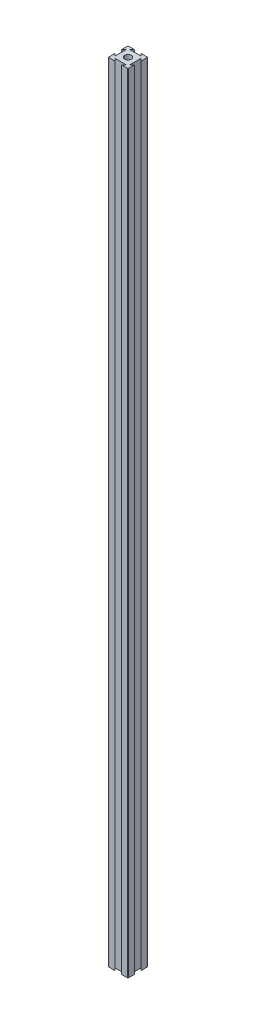
ISO-10303-21;
HEADER;
FILE_DESCRIPTION(('STEP AP214'),'2;1');
FILE_NAME('part.step','',(''),(''),'','','');
FILE_SCHEMA(('AUTOMOTIVE_DESIGN { 1 0 10303 214 1 1 1 1 }'));
ENDSEC;
DATA;
#1=APPLICATION_CONTEXT('core data for automotive mechanical design processes');
#2=APPLICATION_PROTOCOL_DEFINITION('international standard','automotive_design',2000,#1);
#3=PRODUCT_CONTEXT('',#1,'mechanical');
#4=PRODUCT('Part','Part','',(#3));
#5=PRODUCT_RELATED_PRODUCT_CATEGORY('part','',(#4));
#6=PRODUCT_DEFINITION_FORMATION('','',#4);
#7=PRODUCT_DEFINITION_CONTEXT('part definition',#1,'design');
#8=PRODUCT_DEFINITION('design','',#6,#7);
#9=PRODUCT_DEFINITION_SHAPE('','',#8);
#10=(LENGTH_UNIT() NAMED_UNIT(*) SI_UNIT(.MILLI.,.METRE.));
#11=(NAMED_UNIT(*) PLANE_ANGLE_UNIT() SI_UNIT($,.RADIAN.));
#12=(NAMED_UNIT(*) SI_UNIT($,.STERADIAN.) SOLID_ANGLE_UNIT());
#13=UNCERTAINTY_MEASURE_WITH_UNIT(LENGTH_MEASURE(1.E-05),#10,'distance_accuracy_value','');
#14=(GEOMETRIC_REPRESENTATION_CONTEXT(3) GLOBAL_UNCERTAINTY_ASSIGNED_CONTEXT((#13)) GLOBAL_UNIT_ASSIGNED_CONTEXT((#10,
#11,#12)) REPRESENTATION_CONTEXT('',''));
#15=CARTESIAN_POINT('',(0.,0.,0.));
#16=DIRECTION('',(0.,0.,1.));
#17=DIRECTION('',(1.,0.,0.));
#18=AXIS2_PLACEMENT_3D('',#15,#16,#17);
#19=CARTESIAN_POINT('',(16.6666666666667,800.1,-16.6666666666667));
#20=DIRECTION('',(-0.707106781186547,0.,0.707106781186548));
#21=DIRECTION('',(0.707106781186548,0.,0.707106781186547));
#22=AXIS2_PLACEMENT_3D('',#19,#20,#21);
#23=PLANE('',#22);
#24=DIRECTION('',(-0.707106781186548,0.,-0.707106781186547));
#25=VECTOR('',#24,1.);
#26=CARTESIAN_POINT('',(16.6666666666667,0.,-16.6666666666667));
#27=LINE('',#26,#25);
#28=CARTESIAN_POINT('',(20.,0.,-13.3333333333333));
#29=VERTEX_POINT('',#28);
#30=CARTESIAN_POINT('',(17.6183333333333,0.,-15.715));
#31=VERTEX_POINT('',#30);
#32=EDGE_CURVE('E201',#29,#31,#27,.T.);
#33=ORIENTED_EDGE('',*,*,#32,.F.);
#34=DIRECTION('',(0.,-1.,0.));
#35=VECTOR('',#34,1.);
#36=CARTESIAN_POINT('',(20.,800.1,-13.3333333333333));
#37=LINE('',#36,#35);
#38=CARTESIAN_POINT('',(20.,800.1,-13.3333333333333));
#39=VERTEX_POINT('',#38);
#40=EDGE_CURVE('E195',#39,#29,#37,.T.);
#41=ORIENTED_EDGE('',*,*,#40,.F.);
#42=DIRECTION('',(-0.707106781186548,0.,-0.707106781186547));
#43=VECTOR('',#42,1.);
#44=CARTESIAN_POINT('',(16.6666666666667,800.1,-16.6666666666667));
#45=LINE('',#44,#43);
#46=CARTESIAN_POINT('',(17.6183333333333,800.1,-15.715));
#47=VERTEX_POINT('',#46);
#48=EDGE_CURVE('E198',#39,#47,#45,.T.);
#49=ORIENTED_EDGE('',*,*,#48,.T.);
#50=DIRECTION('',(0.,-1.,0.));
#51=VECTOR('',#50,1.);
#52=CARTESIAN_POINT('',(17.6183333333333,800.1,-15.715));
#53=LINE('',#52,#51);
#54=EDGE_CURVE('E269',#47,#31,#53,.T.);
#55=ORIENTED_EDGE('',*,*,#54,.T.);
#56=EDGE_LOOP('',(#33,#41,#49,#55));
#57=FACE_BOUND('',#56,.T.);
#58=ADVANCED_FACE('F35',(#57),#23,.T.);
#59=CARTESIAN_POINT('',(20.,800.1,0.));
#60=DIRECTION('',(-1.,0.,0.));
#61=DIRECTION('',(0.,0.,1.));
#62=AXIS2_PLACEMENT_3D('',#59,#60,#61);
#63=PLANE('',#62);
#64=DIRECTION('',(0.,0.,-1.));
#65=VECTOR('',#64,1.);
#66=CARTESIAN_POINT('',(20.,0.,0.));
#67=LINE('',#66,#65);
#68=CARTESIAN_POINT('',(20.,0.,-19.492));
#69=VERTEX_POINT('',#68);
#70=EDGE_CURVE('E274',#29,#69,#67,.T.);
#71=ORIENTED_EDGE('',*,*,#70,.T.);
#72=DIRECTION('',(0.,-1.,0.));
#73=VECTOR('',#72,1.);
#74=CARTESIAN_POINT('',(20.,800.1,-19.492));
#75=LINE('',#74,#73);
#76=CARTESIAN_POINT('',(20.,800.1,-19.492));
#77=VERTEX_POINT('',#76);
#78=EDGE_CURVE('E212',#69,#77,#75,.F.);
#79=ORIENTED_EDGE('',*,*,#78,.T.);
#80=DIRECTION('',(0.,0.,-1.));
#81=VECTOR('',#80,1.);
#82=CARTESIAN_POINT('',(20.,800.1,0.));
#83=LINE('',#82,#81);
#84=EDGE_CURVE('E209',#39,#77,#83,.T.);
#85=ORIENTED_EDGE('',*,*,#84,.F.);
#86=ORIENTED_EDGE('',*,*,#40,.T.);
#87=EDGE_LOOP('',(#71,#79,#85,#86));
#88=FACE_BOUND('',#87,.T.);
#89=ADVANCED_FACE('F210',(#88),#63,.F.);
#90=CARTESIAN_POINT('',(0.,800.1,-20.));
#91=DIRECTION('',(0.,0.,-1.));
#92=DIRECTION('',(-1.,0.,0.));
#93=AXIS2_PLACEMENT_3D('',#90,#91,#92);
#94=PLANE('',#93);
#95=DIRECTION('',(1.,0.,0.));
#96=VECTOR('',#95,1.);
#97=CARTESIAN_POINT('',(0.,800.1,-20.));
#98=LINE('',#97,#96);
#99=CARTESIAN_POINT('',(13.3333333333333,800.1,-20.));
#100=VERTEX_POINT('',#99);
#101=CARTESIAN_POINT('',(19.492,800.1,-20.));
#102=VERTEX_POINT('',#101);
#103=EDGE_CURVE('E214',#100,#102,#98,.T.);
#104=ORIENTED_EDGE('',*,*,#103,.T.);
#105=DIRECTION('',(0.,-1.,0.));
#106=VECTOR('',#105,1.);
#107=CARTESIAN_POINT('',(19.492,0.,-20.));
#108=LINE('',#107,#106);
#109=CARTESIAN_POINT('',(19.492,0.,-20.));
#110=VERTEX_POINT('',#109);
#111=EDGE_CURVE('E376',#102,#110,#108,.T.);
#112=ORIENTED_EDGE('',*,*,#111,.T.);
#113=DIRECTION('',(1.,0.,0.));
#114=VECTOR('',#113,1.);
#115=CARTESIAN_POINT('',(0.,0.,-20.));
#116=LINE('',#115,#114);
#117=CARTESIAN_POINT('',(13.3333333333333,0.,-20.));
#118=VERTEX_POINT('',#117);
#119=EDGE_CURVE('E276',#118,#110,#116,.T.);
#120=ORIENTED_EDGE('',*,*,#119,.F.);
#121=DIRECTION('',(0.,-1.,0.));
#122=VECTOR('',#121,1.);
#123=CARTESIAN_POINT('',(13.3333333333333,800.1,-20.));
#124=LINE('',#123,#122);
#125=EDGE_CURVE('E206',#100,#118,#124,.T.);
#126=ORIENTED_EDGE('',*,*,#125,.F.);
#127=EDGE_LOOP('',(#104,#112,#120,#126));
#128=FACE_BOUND('',#127,.T.);
#129=ADVANCED_FACE('F408',(#128),#94,.T.);
#130=CARTESIAN_POINT('',(16.6666666666666,800.1,-16.6666666666668));
#131=DIRECTION('',(-0.707106781186544,0.,0.707106781186551));
#132=DIRECTION('',(0.707106781186551,0.,0.707106781186544));
#133=AXIS2_PLACEMENT_3D('',#130,#131,#132);
#134=PLANE('',#133);
#135=DIRECTION('',(-0.707106781186551,0.,-0.707106781186544));
#136=VECTOR('',#135,1.);
#137=CARTESIAN_POINT('',(16.6666666666666,0.,-16.6666666666668));
#138=LINE('',#137,#136);
#139=CARTESIAN_POINT('',(15.715,0.,-17.6183333333334));
#140=VERTEX_POINT('',#139);
#141=EDGE_CURVE('E280',#140,#118,#138,.T.);
#142=ORIENTED_EDGE('',*,*,#141,.F.);
#143=DIRECTION('',(0.,-1.,0.));
#144=VECTOR('',#143,1.);
#145=CARTESIAN_POINT('',(15.715,800.1,-17.6183333333334));
#146=LINE('',#145,#144);
#147=CARTESIAN_POINT('',(15.715,800.1,-17.6183333333334));
#148=VERTEX_POINT('',#147);
#149=EDGE_CURVE('E354',#148,#140,#146,.T.);
#150=ORIENTED_EDGE('',*,*,#149,.F.);
#151=DIRECTION('',(-0.707106781186551,0.,-0.707106781186544));
#152=VECTOR('',#151,1.);
#153=CARTESIAN_POINT('',(16.6666666666666,800.1,-16.6666666666668));
#154=LINE('',#153,#152);
#155=EDGE_CURVE('E230',#148,#100,#154,.T.);
#156=ORIENTED_EDGE('',*,*,#155,.T.);
#157=ORIENTED_EDGE('',*,*,#125,.T.);
#158=EDGE_LOOP('',(#142,#150,#156,#157));
#159=FACE_BOUND('',#158,.T.);
#160=ADVANCED_FACE('F412',(#159),#134,.T.);
#161=CARTESIAN_POINT('',(0.,800.1,-17.6183333333334));
#162=DIRECTION('',(0.,0.,-1.));
#163=DIRECTION('',(-1.,0.,0.));
#164=AXIS2_PLACEMENT_3D('',#161,#162,#163);
#165=PLANE('',#164);
#166=DIRECTION('',(1.,0.,0.));
#167=VECTOR('',#166,1.);
#168=CARTESIAN_POINT('',(0.,0.,-17.6183333333334));
#169=LINE('',#168,#167);
#170=CARTESIAN_POINT('',(4.285,0.,-17.6183333333334));
#171=VERTEX_POINT('',#170);
#172=EDGE_CURVE('E284',#171,#140,#169,.T.);
#173=ORIENTED_EDGE('',*,*,#172,.F.);
#174=DIRECTION('',(0.,-1.,0.));
#175=VECTOR('',#174,1.);
#176=CARTESIAN_POINT('',(4.285,800.1,-17.6183333333334));
#177=LINE('',#176,#175);
#178=CARTESIAN_POINT('',(4.285,800.1,-17.6183333333334));
#179=VERTEX_POINT('',#178);
#180=EDGE_CURVE('E352',#179,#171,#177,.T.);
#181=ORIENTED_EDGE('',*,*,#180,.F.);
#182=DIRECTION('',(1.,0.,0.));
#183=VECTOR('',#182,1.);
#184=CARTESIAN_POINT('',(0.,800.1,-17.6183333333334));
#185=LINE('',#184,#183);
#186=EDGE_CURVE('E234',#179,#148,#185,.T.);
#187=ORIENTED_EDGE('',*,*,#186,.T.);
#188=ORIENTED_EDGE('',*,*,#149,.T.);
#189=EDGE_LOOP('',(#173,#181,#187,#188));
#190=FACE_BOUND('',#189,.T.);
#191=ADVANCED_FACE('F439',(#190),#165,.T.);
#192=CARTESIAN_POINT('',(-6.6666666666667,800.1,-6.66666666666677));
#193=DIRECTION('',(0.707106781186544,0.,0.707106781186551));
#194=DIRECTION('',(0.707106781186551,0.,-0.707106781186544));
#195=AXIS2_PLACEMENT_3D('',#192,#193,#194);
#196=PLANE('',#195);
#197=DIRECTION('',(-0.707106781186551,0.,0.707106781186544));
#198=VECTOR('',#197,1.);
#199=CARTESIAN_POINT('',(-6.6666666666667,0.,-6.66666666666677));
#200=LINE('',#199,#198);
#201=CARTESIAN_POINT('',(6.66666666666666,0.,-20.));
#202=VERTEX_POINT('',#201);
#203=EDGE_CURVE('E287',#202,#171,#200,.T.);
#204=ORIENTED_EDGE('',*,*,#203,.F.);
#205=DIRECTION('',(0.,-1.,0.));
#206=VECTOR('',#205,1.);
#207=CARTESIAN_POINT('',(6.66666666666666,800.1,-20.));
#208=LINE('',#207,#206);
#209=CARTESIAN_POINT('',(6.66666666666666,800.1,-20.));
#210=VERTEX_POINT('',#209);
#211=EDGE_CURVE('E349',#210,#202,#208,.T.);
#212=ORIENTED_EDGE('',*,*,#211,.F.);
#213=DIRECTION('',(-0.707106781186551,0.,0.707106781186544));
#214=VECTOR('',#213,1.);
#215=CARTESIAN_POINT('',(-6.6666666666667,800.1,-6.66666666666677));
#216=LINE('',#215,#214);
#217=EDGE_CURVE('E237',#210,#179,#216,.T.);
#218=ORIENTED_EDGE('',*,*,#217,.T.);
#219=ORIENTED_EDGE('',*,*,#180,.T.);
#220=EDGE_LOOP('',(#204,#212,#218,#219));
#221=FACE_BOUND('',#220,.T.);
#222=ADVANCED_FACE('F442',(#221),#196,.T.);
#223=CARTESIAN_POINT('',(0.508,0.,-20.));
#224=VERTEX_POINT('',#223);
#225=EDGE_CURVE('E281',#224,#202,#116,.T.);
#226=ORIENTED_EDGE('',*,*,#225,.F.);
#227=DIRECTION('',(0.,-1.,0.));
#228=VECTOR('',#227,1.);
#229=CARTESIAN_POINT('',(0.508,800.1,-20.));
#230=LINE('',#229,#228);
#231=CARTESIAN_POINT('',(0.508,800.1,-20.));
#232=VERTEX_POINT('',#231);
#233=EDGE_CURVE('E367',#224,#232,#230,.F.);
#234=ORIENTED_EDGE('',*,*,#233,.T.);
#235=EDGE_CURVE('E231',#232,#210,#98,.T.);
#236=ORIENTED_EDGE('',*,*,#235,.T.);
#237=ORIENTED_EDGE('',*,*,#211,.T.);
#238=EDGE_LOOP('',(#226,#234,#236,#237));
#239=FACE_BOUND('',#238,.T.);
#240=ADVANCED_FACE('F505',(#239),#94,.T.);
#241=CARTESIAN_POINT('',(0.,800.1,0.));
#242=DIRECTION('',(-1.,0.,0.));
#243=DIRECTION('',(0.,0.,1.));
#244=AXIS2_PLACEMENT_3D('',#241,#242,#243);
#245=PLANE('',#244);
#246=DIRECTION('',(0.,0.,-1.));
#247=VECTOR('',#246,1.);
#248=CARTESIAN_POINT('',(0.,800.1,0.));
#249=LINE('',#248,#247);
#250=CARTESIAN_POINT('',(0.,800.1,-13.3333333333333));
#251=VERTEX_POINT('',#250);
#252=CARTESIAN_POINT('',(0.,800.1,-19.492));
#253=VERTEX_POINT('',#252);
#254=EDGE_CURVE('E240',#251,#253,#249,.T.);
#255=ORIENTED_EDGE('',*,*,#254,.T.);
#256=DIRECTION('',(0.,-1.,0.));
#257=VECTOR('',#256,1.);
#258=CARTESIAN_POINT('',(0.,800.1,-19.492));
#259=LINE('',#258,#257);
#260=CARTESIAN_POINT('',(0.,0.,-19.492));
#261=VERTEX_POINT('',#260);
#262=EDGE_CURVE('E205',#253,#261,#259,.T.);
#263=ORIENTED_EDGE('',*,*,#262,.T.);
#264=DIRECTION('',(0.,0.,-1.));
#265=VECTOR('',#264,1.);
#266=CARTESIAN_POINT('',(0.,0.,0.));
#267=LINE('',#266,#265);
#268=CARTESIAN_POINT('',(0.,0.,-13.3333333333333));
#269=VERTEX_POINT('',#268);
#270=EDGE_CURVE('E290',#269,#261,#267,.T.);
#271=ORIENTED_EDGE('',*,*,#270,.F.);
#272=DIRECTION('',(0.,-1.,0.));
#273=VECTOR('',#272,1.);
#274=CARTESIAN_POINT('',(0.,800.1,-13.3333333333333));
#275=LINE('',#274,#273);
#276=EDGE_CURVE('E347',#251,#269,#275,.T.);
#277=ORIENTED_EDGE('',*,*,#276,.F.);
#278=EDGE_LOOP('',(#255,#263,#271,#277));
#279=FACE_BOUND('',#278,.T.);
#280=ADVANCED_FACE('F451',(#279),#245,.T.);
#281=CARTESIAN_POINT('',(-6.66666666666667,800.1,-6.66666666666669));
#282=DIRECTION('',(-0.707106781186546,0.,-0.707106781186549));
#283=DIRECTION('',(-0.707106781186549,0.,0.707106781186546));
#284=AXIS2_PLACEMENT_3D('',#281,#282,#283);
#285=PLANE('',#284);
#286=DIRECTION('',(0.707106781186549,0.,-0.707106781186547));
#287=VECTOR('',#286,1.);
#288=CARTESIAN_POINT('',(-6.66666666666667,0.,-6.66666666666669));
#289=LINE('',#288,#287);
#290=CARTESIAN_POINT('',(2.38166666666667,0.,-15.715));
#291=VERTEX_POINT('',#290);
#292=EDGE_CURVE('E293',#269,#291,#289,.T.);
#293=ORIENTED_EDGE('',*,*,#292,.T.);
#294=DIRECTION('',(0.,-1.,0.));
#295=VECTOR('',#294,1.);
#296=CARTESIAN_POINT('',(2.38166666666667,800.1,-15.715));
#297=LINE('',#296,#295);
#298=CARTESIAN_POINT('',(2.38166666666667,800.1,-15.715));
#299=VERTEX_POINT('',#298);
#300=EDGE_CURVE('E344',#299,#291,#297,.T.);
#301=ORIENTED_EDGE('',*,*,#300,.F.);
#302=DIRECTION('',(0.707106781186549,0.,-0.707106781186547));
#303=VECTOR('',#302,1.);
#304=CARTESIAN_POINT('',(-6.66666666666667,800.1,-6.66666666666669));
#305=LINE('',#304,#303);
#306=EDGE_CURVE('E243',#251,#299,#305,.T.);
#307=ORIENTED_EDGE('',*,*,#306,.F.);
#308=ORIENTED_EDGE('',*,*,#276,.T.);
#309=EDGE_LOOP('',(#293,#301,#307,#308));
#310=FACE_BOUND('',#309,.T.);
#311=ADVANCED_FACE('F456',(#310),#285,.F.);
#312=CARTESIAN_POINT('',(2.38166666666667,800.1,0.));
#313=DIRECTION('',(1.,0.,0.));
#314=DIRECTION('',(0.,0.,-1.));
#315=AXIS2_PLACEMENT_3D('',#312,#313,#314);
#316=PLANE('',#315);
#317=DIRECTION('',(0.,0.,1.));
#318=VECTOR('',#317,1.);
#319=CARTESIAN_POINT('',(2.38166666666667,0.,0.));
#320=LINE('',#319,#318);
#321=CARTESIAN_POINT('',(2.38166666666667,0.,-4.285));
#322=VERTEX_POINT('',#321);
#323=EDGE_CURVE('E297',#291,#322,#320,.T.);
#324=ORIENTED_EDGE('',*,*,#323,.T.);
#325=DIRECTION('',(0.,-1.,0.));
#326=VECTOR('',#325,1.);
#327=CARTESIAN_POINT('',(2.38166666666667,800.1,-4.285));
#328=LINE('',#327,#326);
#329=CARTESIAN_POINT('',(2.38166666666667,800.1,-4.285));
#330=VERTEX_POINT('',#329);
#331=EDGE_CURVE('E341',#330,#322,#328,.T.);
#332=ORIENTED_EDGE('',*,*,#331,.F.);
#333=DIRECTION('',(0.,0.,1.));
#334=VECTOR('',#333,1.);
#335=CARTESIAN_POINT('',(2.38166666666667,800.1,0.));
#336=LINE('',#335,#334);
#337=EDGE_CURVE('E247',#299,#330,#336,.T.);
#338=ORIENTED_EDGE('',*,*,#337,.F.);
#339=ORIENTED_EDGE('',*,*,#300,.T.);
#340=EDGE_LOOP('',(#324,#332,#338,#339));
#341=FACE_BOUND('',#340,.T.);
#342=ADVANCED_FACE('F462',(#341),#316,.F.);
#343=CARTESIAN_POINT('',(3.33333333333333,800.1,-3.33333333333335));
#344=DIRECTION('',(-0.707106781186546,0.,0.707106781186549));
#345=DIRECTION('',(0.707106781186549,0.,0.707106781186546));
#346=AXIS2_PLACEMENT_3D('',#343,#344,#345);
#347=PLANE('',#346);
#348=DIRECTION('',(-0.707106781186549,0.,-0.707106781186546));
#349=VECTOR('',#348,1.);
#350=CARTESIAN_POINT('',(3.33333333333333,0.,-3.33333333333335));
#351=LINE('',#350,#349);
#352=CARTESIAN_POINT('',(0.,0.,-6.66666666666667));
#353=VERTEX_POINT('',#352);
#354=EDGE_CURVE('E300',#322,#353,#351,.T.);
#355=ORIENTED_EDGE('',*,*,#354,.T.);
#356=DIRECTION('',(0.,-1.,0.));
#357=VECTOR('',#356,1.);
#358=CARTESIAN_POINT('',(0.,800.1,-6.66666666666667));
#359=LINE('',#358,#357);
#360=CARTESIAN_POINT('',(0.,800.1,-6.66666666666667));
#361=VERTEX_POINT('',#360);
#362=EDGE_CURVE('E338',#361,#353,#359,.T.);
#363=ORIENTED_EDGE('',*,*,#362,.F.);
#364=DIRECTION('',(-0.707106781186549,0.,-0.707106781186546));
#365=VECTOR('',#364,1.);
#366=CARTESIAN_POINT('',(3.33333333333333,800.1,-3.33333333333335));
#367=LINE('',#366,#365);
#368=EDGE_CURVE('E250',#330,#361,#367,.T.);
#369=ORIENTED_EDGE('',*,*,#368,.F.);
#370=ORIENTED_EDGE('',*,*,#331,.T.);
#371=EDGE_LOOP('',(#355,#363,#369,#370));
#372=FACE_BOUND('',#371,.T.);
#373=ADVANCED_FACE('F464',(#372),#347,.F.);
#374=CARTESIAN_POINT('',(0.,0.,-0.508));
#375=VERTEX_POINT('',#374);
#376=EDGE_CURVE('E294',#375,#353,#267,.T.);
#377=ORIENTED_EDGE('',*,*,#376,.F.);
#378=DIRECTION('',(0.,-1.,0.));
#379=VECTOR('',#378,1.);
#380=CARTESIAN_POINT('',(0.,800.1,-0.508));
#381=LINE('',#380,#379);
#382=CARTESIAN_POINT('',(0.,800.1,-0.508));
#383=VERTEX_POINT('',#382);
#384=EDGE_CURVE('E383',#375,#383,#381,.F.);
#385=ORIENTED_EDGE('',*,*,#384,.T.);
#386=EDGE_CURVE('E244',#383,#361,#249,.T.);
#387=ORIENTED_EDGE('',*,*,#386,.T.);
#388=ORIENTED_EDGE('',*,*,#362,.T.);
#389=EDGE_LOOP('',(#377,#385,#387,#388));
#390=FACE_BOUND('',#389,.T.);
#391=ADVANCED_FACE('F467',(#390),#245,.T.);
#392=CARTESIAN_POINT('',(0.,800.1,0.));
#393=DIRECTION('',(0.,0.,-1.));
#394=DIRECTION('',(-1.,0.,0.));
#395=AXIS2_PLACEMENT_3D('',#392,#393,#394);
#396=PLANE('',#395);
#397=DIRECTION('',(1.,0.,0.));
#398=VECTOR('',#397,1.);
#399=CARTESIAN_POINT('',(0.,800.1,0.));
#400=LINE('',#399,#398);
#401=CARTESIAN_POINT('',(0.508,800.1,0.));
#402=VERTEX_POINT('',#401);
#403=CARTESIAN_POINT('',(6.66666666666667,800.1,0.));
#404=VERTEX_POINT('',#403);
#405=EDGE_CURVE('E253',#402,#404,#400,.T.);
#406=ORIENTED_EDGE('',*,*,#405,.F.);
#407=DIRECTION('',(0.,-1.,0.));
#408=VECTOR('',#407,1.);
#409=CARTESIAN_POINT('',(0.508,0.,0.));
#410=LINE('',#409,#408);
#411=CARTESIAN_POINT('',(0.508,0.,0.));
#412=VERTEX_POINT('',#411);
#413=EDGE_CURVE('E380',#402,#412,#410,.T.);
#414=ORIENTED_EDGE('',*,*,#413,.T.);
#415=DIRECTION('',(1.,0.,0.));
#416=VECTOR('',#415,1.);
#417=CARTESIAN_POINT('',(0.,0.,0.));
#418=LINE('',#417,#416);
#419=CARTESIAN_POINT('',(6.66666666666667,0.,0.));
#420=VERTEX_POINT('',#419);
#421=EDGE_CURVE('E303',#412,#420,#418,.T.);
#422=ORIENTED_EDGE('',*,*,#421,.T.);
#423=DIRECTION('',(0.,-1.,0.));
#424=VECTOR('',#423,1.);
#425=CARTESIAN_POINT('',(6.66666666666667,800.1,0.));
#426=LINE('',#425,#424);
#427=EDGE_CURVE('E335',#404,#420,#426,.T.);
#428=ORIENTED_EDGE('',*,*,#427,.F.);
#429=EDGE_LOOP('',(#406,#414,#422,#428));
#430=FACE_BOUND('',#429,.T.);
#431=ADVANCED_FACE('F474',(#430),#396,.F.);
#432=CARTESIAN_POINT('',(3.3333333333333,800.1,-3.33333333333333));
#433=DIRECTION('',(-0.707106781186544,0.,0.707106781186551));
#434=DIRECTION('',(0.707106781186551,0.,0.707106781186544));
#435=AXIS2_PLACEMENT_3D('',#432,#433,#434);
#436=PLANE('',#435);
#437=DIRECTION('',(-0.707106781186551,0.,-0.707106781186544));
#438=VECTOR('',#437,1.);
#439=CARTESIAN_POINT('',(3.3333333333333,0.,-3.33333333333333));
#440=LINE('',#439,#438);
#441=CARTESIAN_POINT('',(4.285,0.,-2.38166666666664));
#442=VERTEX_POINT('',#441);
#443=EDGE_CURVE('E305',#420,#442,#440,.T.);
#444=ORIENTED_EDGE('',*,*,#443,.T.);
#445=DIRECTION('',(0.,-1.,0.));
#446=VECTOR('',#445,1.);
#447=CARTESIAN_POINT('',(4.285,800.1,-2.38166666666664));
#448=LINE('',#447,#446);
#449=CARTESIAN_POINT('',(4.285,800.1,-2.38166666666664));
#450=VERTEX_POINT('',#449);
#451=EDGE_CURVE('E332',#450,#442,#448,.T.);
#452=ORIENTED_EDGE('',*,*,#451,.F.);
#453=DIRECTION('',(-0.707106781186551,0.,-0.707106781186544));
#454=VECTOR('',#453,1.);
#455=CARTESIAN_POINT('',(3.3333333333333,800.1,-3.33333333333333));
#456=LINE('',#455,#454);
#457=EDGE_CURVE('E255',#404,#450,#456,.T.);
#458=ORIENTED_EDGE('',*,*,#457,.F.);
#459=ORIENTED_EDGE('',*,*,#427,.T.);
#460=EDGE_LOOP('',(#444,#452,#458,#459));
#461=FACE_BOUND('',#460,.T.);
#462=ADVANCED_FACE('F480',(#461),#436,.F.);
#463=CARTESIAN_POINT('',(0.,800.1,-2.38166666666664));
#464=DIRECTION('',(0.,0.,-1.));
#465=DIRECTION('',(-1.,0.,0.));
#466=AXIS2_PLACEMENT_3D('',#463,#464,#465);
#467=PLANE('',#466);
#468=DIRECTION('',(1.,0.,0.));
#469=VECTOR('',#468,1.);
#470=CARTESIAN_POINT('',(0.,0.,-2.38166666666664));
#471=LINE('',#470,#469);
#472=CARTESIAN_POINT('',(15.715,0.,-2.38166666666664));
#473=VERTEX_POINT('',#472);
#474=EDGE_CURVE('E309',#442,#473,#471,.T.);
#475=ORIENTED_EDGE('',*,*,#474,.T.);
#476=DIRECTION('',(0.,-1.,0.));
#477=VECTOR('',#476,1.);
#478=CARTESIAN_POINT('',(15.715,800.1,-2.38166666666664));
#479=LINE('',#478,#477);
#480=CARTESIAN_POINT('',(15.715,800.1,-2.38166666666664));
#481=VERTEX_POINT('',#480);
#482=EDGE_CURVE('E329',#481,#473,#479,.T.);
#483=ORIENTED_EDGE('',*,*,#482,.F.);
#484=DIRECTION('',(1.,0.,0.));
#485=VECTOR('',#484,1.);
#486=CARTESIAN_POINT('',(0.,800.1,-2.38166666666664));
#487=LINE('',#486,#485);
#488=EDGE_CURVE('E259',#450,#481,#487,.T.);
#489=ORIENTED_EDGE('',*,*,#488,.F.);
#490=ORIENTED_EDGE('',*,*,#451,.T.);
#491=EDGE_LOOP('',(#475,#483,#489,#490));
#492=FACE_BOUND('',#491,.T.);
#493=ADVANCED_FACE('F483',(#492),#467,.F.);
#494=CARTESIAN_POINT('',(6.66666666666659,800.1,6.66666666666667));
#495=DIRECTION('',(0.707106781186544,0.,0.707106781186551));
#496=DIRECTION('',(0.707106781186551,0.,-0.707106781186544));
#497=AXIS2_PLACEMENT_3D('',#494,#495,#496);
#498=PLANE('',#497);
#499=DIRECTION('',(-0.707106781186551,0.,0.707106781186544));
#500=VECTOR('',#499,1.);
#501=CARTESIAN_POINT('',(6.66666666666659,0.,6.66666666666667));
#502=LINE('',#501,#500);
#503=CARTESIAN_POINT('',(13.3333333333333,0.,0.));
#504=VERTEX_POINT('',#503);
#505=EDGE_CURVE('E312',#473,#504,#502,.T.);
#506=ORIENTED_EDGE('',*,*,#505,.T.);
#507=DIRECTION('',(0.,-1.,0.));
#508=VECTOR('',#507,1.);
#509=CARTESIAN_POINT('',(13.3333333333333,800.1,0.));
#510=LINE('',#509,#508);
#511=CARTESIAN_POINT('',(13.3333333333333,800.1,0.));
#512=VERTEX_POINT('',#511);
#513=EDGE_CURVE('E326',#512,#504,#510,.T.);
#514=ORIENTED_EDGE('',*,*,#513,.F.);
#515=DIRECTION('',(-0.707106781186551,0.,0.707106781186544));
#516=VECTOR('',#515,1.);
#517=CARTESIAN_POINT('',(6.66666666666659,800.1,6.66666666666667));
#518=LINE('',#517,#516);
#519=EDGE_CURVE('E262',#481,#512,#518,.T.);
#520=ORIENTED_EDGE('',*,*,#519,.F.);
#521=ORIENTED_EDGE('',*,*,#482,.T.);
#522=EDGE_LOOP('',(#506,#514,#520,#521));
#523=FACE_BOUND('',#522,.T.);
#524=ADVANCED_FACE('F485',(#523),#498,.F.);
#525=CARTESIAN_POINT('',(19.492,0.,0.));
#526=VERTEX_POINT('',#525);
#527=EDGE_CURVE('E306',#504,#526,#418,.T.);
#528=ORIENTED_EDGE('',*,*,#527,.T.);
#529=DIRECTION('',(0.,-1.,0.));
#530=VECTOR('',#529,1.);
#531=CARTESIAN_POINT('',(19.492,800.1,0.));
#532=LINE('',#531,#530);
#533=CARTESIAN_POINT('',(19.492,800.1,0.));
#534=VERTEX_POINT('',#533);
#535=EDGE_CURVE('E11',#526,#534,#532,.F.);
#536=ORIENTED_EDGE('',*,*,#535,.T.);
#537=EDGE_CURVE('E256',#512,#534,#400,.T.);
#538=ORIENTED_EDGE('',*,*,#537,.F.);
#539=ORIENTED_EDGE('',*,*,#513,.T.);
#540=EDGE_LOOP('',(#528,#536,#538,#539));
#541=FACE_BOUND('',#540,.T.);
#542=ADVANCED_FACE('F394',(#541),#396,.F.);
#543=CARTESIAN_POINT('',(20.,800.1,-0.508));
#544=VERTEX_POINT('',#543);
#545=CARTESIAN_POINT('',(20.,800.1,-6.66666666666667));
#546=VERTEX_POINT('',#545);
#547=EDGE_CURVE('E216',#544,#546,#83,.T.);
#548=ORIENTED_EDGE('',*,*,#547,.F.);
#549=DIRECTION('',(0.,-1.,0.));
#550=VECTOR('',#549,1.);
#551=CARTESIAN_POINT('',(20.,800.1,-0.508));
#552=LINE('',#551,#550);
#553=CARTESIAN_POINT('',(20.,0.,-0.508));
#554=VERTEX_POINT('',#553);
#555=EDGE_CURVE('E43',#544,#554,#552,.T.);
#556=ORIENTED_EDGE('',*,*,#555,.T.);
#557=CARTESIAN_POINT('',(20.,0.,-6.66666666666667));
#558=VERTEX_POINT('',#557);
#559=EDGE_CURVE('E277',#554,#558,#67,.T.);
#560=ORIENTED_EDGE('',*,*,#559,.T.);
#561=DIRECTION('',(0.,-1.,0.));
#562=VECTOR('',#561,1.);
#563=CARTESIAN_POINT('',(20.,800.1,-6.66666666666667));
#564=LINE('',#563,#562);
#565=EDGE_CURVE('E323',#546,#558,#564,.T.);
#566=ORIENTED_EDGE('',*,*,#565,.F.);
#567=EDGE_LOOP('',(#548,#556,#560,#566));
#568=FACE_BOUND('',#567,.T.);
#569=ADVANCED_FACE('F388',(#568),#63,.F.);
#570=CARTESIAN_POINT('',(6.66666666666663,800.1,6.66666666666666));
#571=DIRECTION('',(-0.707106781186546,0.,-0.707106781186549));
#572=DIRECTION('',(-0.707106781186549,0.,0.707106781186546));
#573=AXIS2_PLACEMENT_3D('',#570,#571,#572);
#574=PLANE('',#573);
#575=DIRECTION('',(0.707106781186549,0.,-0.707106781186546));
#576=VECTOR('',#575,1.);
#577=CARTESIAN_POINT('',(6.66666666666663,0.,6.66666666666666));
#578=LINE('',#577,#576);
#579=CARTESIAN_POINT('',(17.6183333333333,0.,-4.285));
#580=VERTEX_POINT('',#579);
#581=EDGE_CURVE('E315',#580,#558,#578,.T.);
#582=ORIENTED_EDGE('',*,*,#581,.F.);
#583=DIRECTION('',(0.,-1.,0.));
#584=VECTOR('',#583,1.);
#585=CARTESIAN_POINT('',(17.6183333333333,800.1,-4.285));
#586=LINE('',#585,#584);
#587=CARTESIAN_POINT('',(17.6183333333333,800.1,-4.285));
#588=VERTEX_POINT('',#587);
#589=EDGE_CURVE('E321',#588,#580,#586,.T.);
#590=ORIENTED_EDGE('',*,*,#589,.F.);
#591=DIRECTION('',(0.707106781186549,0.,-0.707106781186546));
#592=VECTOR('',#591,1.);
#593=CARTESIAN_POINT('',(6.66666666666663,800.1,6.66666666666666));
#594=LINE('',#593,#592);
#595=EDGE_CURVE('E265',#588,#546,#594,.T.);
#596=ORIENTED_EDGE('',*,*,#595,.T.);
#597=ORIENTED_EDGE('',*,*,#565,.T.);
#598=EDGE_LOOP('',(#582,#590,#596,#597));
#599=FACE_BOUND('',#598,.T.);
#600=ADVANCED_FACE('F418',(#599),#574,.T.);
#601=CARTESIAN_POINT('',(10.,800.1,-10.));
#602=DIRECTION('',(0.,-1.,0.));
#603=DIRECTION('',(0.,0.,-1.));
#604=AXIS2_PLACEMENT_3D('',#601,#602,#603);
#605=CYLINDRICAL_SURFACE('',#604,3.33333333333333);
#606=CARTESIAN_POINT('',(10.,800.1,-10.));
#607=DIRECTION('',(0.,1.,0.));
#608=DIRECTION('',(0.,0.,1.));
#609=AXIS2_PLACEMENT_3D('',#606,#607,#608);
#610=CIRCLE('',#609,3.33333333333333);
#611=CARTESIAN_POINT('',(10.,800.1,-6.66666666666667));
#612=VERTEX_POINT('',#611);
#613=EDGE_CURVE('E222',#612,#612,#610,.T.);
#614=ORIENTED_EDGE('',*,*,#613,.T.);
#615=EDGE_LOOP('',(#614));
#616=FACE_BOUND('',#615,.T.);
#617=CARTESIAN_POINT('',(10.,0.,-10.));
#618=DIRECTION('',(0.,1.,0.));
#619=DIRECTION('',(0.,0.,1.));
#620=AXIS2_PLACEMENT_3D('',#617,#618,#619);
#621=CIRCLE('',#620,3.33333333333333);
#622=CARTESIAN_POINT('',(10.,0.,-6.66666666666667));
#623=VERTEX_POINT('',#622);
#624=EDGE_CURVE('E270',#623,#623,#621,.T.);
#625=ORIENTED_EDGE('',*,*,#624,.F.);
#626=EDGE_LOOP('',(#625));
#627=FACE_BOUND('',#626,.T.);
#628=ADVANCED_FACE('F414',(#616,#627),#605,.F.);
#629=CARTESIAN_POINT('',(17.6183333333333,800.1,0.));
#630=DIRECTION('',(1.,0.,0.));
#631=DIRECTION('',(0.,0.,-1.));
#632=AXIS2_PLACEMENT_3D('',#629,#630,#631);
#633=PLANE('',#632);
#634=DIRECTION('',(0.,0.,1.));
#635=VECTOR('',#634,1.);
#636=CARTESIAN_POINT('',(17.6183333333333,0.,0.));
#637=LINE('',#636,#635);
#638=EDGE_CURVE('E225',#31,#580,#637,.T.);
#639=ORIENTED_EDGE('',*,*,#638,.F.);
#640=ORIENTED_EDGE('',*,*,#54,.F.);
#641=DIRECTION('',(0.,0.,1.));
#642=VECTOR('',#641,1.);
#643=CARTESIAN_POINT('',(17.6183333333333,800.1,0.));
#644=LINE('',#643,#642);
#645=EDGE_CURVE('E221',#47,#588,#644,.T.);
#646=ORIENTED_EDGE('',*,*,#645,.T.);
#647=ORIENTED_EDGE('',*,*,#589,.T.);
#648=EDGE_LOOP('',(#639,#640,#646,#647));
#649=FACE_BOUND('',#648,.T.);
#650=ADVANCED_FACE('F417',(#649),#633,.T.);
#651=CARTESIAN_POINT('',(0.,800.1,0.));
#652=DIRECTION('',(0.,1.,0.));
#653=DIRECTION('',(0.,0.,1.));
#654=AXIS2_PLACEMENT_3D('',#651,#652,#653);
#655=PLANE('',#654);
#656=ORIENTED_EDGE('',*,*,#613,.F.);
#657=EDGE_LOOP('',(#656));
#658=FACE_BOUND('',#657,.T.);
#659=ORIENTED_EDGE('',*,*,#235,.F.);
#660=CARTESIAN_POINT('',(0.508,800.1,-19.492));
#661=DIRECTION('',(0.,1.,0.));
#662=DIRECTION('',(0.,0.,1.));
#663=AXIS2_PLACEMENT_3D('',#660,#661,#662);
#664=CIRCLE('',#663,0.508);
#665=EDGE_CURVE('E374',#232,#253,#664,.T.);
#666=ORIENTED_EDGE('',*,*,#665,.T.);
#667=ORIENTED_EDGE('',*,*,#254,.F.);
#668=ORIENTED_EDGE('',*,*,#306,.T.);
#669=ORIENTED_EDGE('',*,*,#337,.T.);
#670=ORIENTED_EDGE('',*,*,#368,.T.);
#671=ORIENTED_EDGE('',*,*,#386,.F.);
#672=CARTESIAN_POINT('',(0.508,800.1,-0.508));
#673=DIRECTION('',(0.,1.,0.));
#674=DIRECTION('',(0.,0.,1.));
#675=AXIS2_PLACEMENT_3D('',#672,#673,#674);
#676=CIRCLE('',#675,0.508);
#677=EDGE_CURVE('E370',#383,#402,#676,.T.);
#678=ORIENTED_EDGE('',*,*,#677,.T.);
#679=ORIENTED_EDGE('',*,*,#405,.T.);
#680=ORIENTED_EDGE('',*,*,#457,.T.);
#681=ORIENTED_EDGE('',*,*,#488,.T.);
#682=ORIENTED_EDGE('',*,*,#519,.T.);
#683=ORIENTED_EDGE('',*,*,#537,.T.);
#684=CARTESIAN_POINT('',(19.492,800.1,-0.508));
#685=DIRECTION('',(0.,1.,0.));
#686=DIRECTION('',(0.,0.,1.));
#687=AXIS2_PLACEMENT_3D('',#684,#685,#686);
#688=CIRCLE('',#687,0.508);
#689=EDGE_CURVE('E50',#534,#544,#688,.T.);
#690=ORIENTED_EDGE('',*,*,#689,.T.);
#691=ORIENTED_EDGE('',*,*,#547,.T.);
#692=ORIENTED_EDGE('',*,*,#595,.F.);
#693=ORIENTED_EDGE('',*,*,#645,.F.);
#694=ORIENTED_EDGE('',*,*,#48,.F.);
#695=ORIENTED_EDGE('',*,*,#84,.T.);
#696=CARTESIAN_POINT('',(19.492,800.1,-19.492));
#697=DIRECTION('',(0.,1.,0.));
#698=DIRECTION('',(0.,0.,1.));
#699=AXIS2_PLACEMENT_3D('',#696,#697,#698);
#700=CIRCLE('',#699,0.508);
#701=EDGE_CURVE('E372',#77,#102,#700,.T.);
#702=ORIENTED_EDGE('',*,*,#701,.T.);
#703=ORIENTED_EDGE('',*,*,#103,.F.);
#704=ORIENTED_EDGE('',*,*,#155,.F.);
#705=ORIENTED_EDGE('',*,*,#186,.F.);
#706=ORIENTED_EDGE('',*,*,#217,.F.);
#707=EDGE_LOOP('',(#659,#666,#667,#668,#669,#670,#671,#678,#679,#680,#681,#682,#683,#690,#691,
#692,#693,#694,#695,#702,#703,#704,#705,#706));
#708=FACE_BOUND('',#707,.T.);
#709=ADVANCED_FACE('F218',(#658,#708),#655,.T.);
#710=CARTESIAN_POINT('',(0.,0.,0.));
#711=DIRECTION('',(0.,1.,0.));
#712=DIRECTION('',(0.,0.,1.));
#713=AXIS2_PLACEMENT_3D('',#710,#711,#712);
#714=PLANE('',#713);
#715=ORIENTED_EDGE('',*,*,#624,.T.);
#716=EDGE_LOOP('',(#715));
#717=FACE_BOUND('',#716,.T.);
#718=ORIENTED_EDGE('',*,*,#270,.T.);
#719=CARTESIAN_POINT('',(0.508,0.,-19.492));
#720=DIRECTION('',(0.,1.,0.));
#721=DIRECTION('',(0.,0.,1.));
#722=AXIS2_PLACEMENT_3D('',#719,#720,#721);
#723=CIRCLE('',#722,0.508);
#724=EDGE_CURVE('E365',#261,#224,#723,.F.);
#725=ORIENTED_EDGE('',*,*,#724,.T.);
#726=ORIENTED_EDGE('',*,*,#225,.T.);
#727=ORIENTED_EDGE('',*,*,#203,.T.);
#728=ORIENTED_EDGE('',*,*,#172,.T.);
#729=ORIENTED_EDGE('',*,*,#141,.T.);
#730=ORIENTED_EDGE('',*,*,#119,.T.);
#731=CARTESIAN_POINT('',(19.492,0.,-19.492));
#732=DIRECTION('',(0.,1.,0.));
#733=DIRECTION('',(0.,0.,1.));
#734=AXIS2_PLACEMENT_3D('',#731,#732,#733);
#735=CIRCLE('',#734,0.508);
#736=EDGE_CURVE('E363',#110,#69,#735,.F.);
#737=ORIENTED_EDGE('',*,*,#736,.T.);
#738=ORIENTED_EDGE('',*,*,#70,.F.);
#739=ORIENTED_EDGE('',*,*,#32,.T.);
#740=ORIENTED_EDGE('',*,*,#638,.T.);
#741=ORIENTED_EDGE('',*,*,#581,.T.);
#742=ORIENTED_EDGE('',*,*,#559,.F.);
#743=CARTESIAN_POINT('',(19.492,0.,-0.508));
#744=DIRECTION('',(0.,1.,0.));
#745=DIRECTION('',(0.,0.,1.));
#746=AXIS2_PLACEMENT_3D('',#743,#744,#745);
#747=CIRCLE('',#746,0.508);
#748=EDGE_CURVE('E359',#554,#526,#747,.F.);
#749=ORIENTED_EDGE('',*,*,#748,.T.);
#750=ORIENTED_EDGE('',*,*,#527,.F.);
#751=ORIENTED_EDGE('',*,*,#505,.F.);
#752=ORIENTED_EDGE('',*,*,#474,.F.);
#753=ORIENTED_EDGE('',*,*,#443,.F.);
#754=ORIENTED_EDGE('',*,*,#421,.F.);
#755=CARTESIAN_POINT('',(0.508,0.,-0.508));
#756=DIRECTION('',(0.,1.,0.));
#757=DIRECTION('',(0.,0.,1.));
#758=AXIS2_PLACEMENT_3D('',#755,#756,#757);
#759=CIRCLE('',#758,0.508);
#760=EDGE_CURVE('E361',#412,#375,#759,.F.);
#761=ORIENTED_EDGE('',*,*,#760,.T.);
#762=ORIENTED_EDGE('',*,*,#376,.T.);
#763=ORIENTED_EDGE('',*,*,#354,.F.);
#764=ORIENTED_EDGE('',*,*,#323,.F.);
#765=ORIENTED_EDGE('',*,*,#292,.F.);
#766=EDGE_LOOP('',(#718,#725,#726,#727,#728,#729,#730,#737,#738,#739,#740,#741,#742,#749,#750,
#751,#752,#753,#754,#761,#762,#763,#764,#765));
#767=FACE_BOUND('',#766,.T.);
#768=ADVANCED_FACE('F392',(#717,#767),#714,.F.);
#769=CARTESIAN_POINT('',(0.508,800.1,-19.492));
#770=DIRECTION('',(0.,-1.,0.));
#771=DIRECTION('',(0.,0.,-1.));
#772=AXIS2_PLACEMENT_3D('',#769,#770,#771);
#773=CYLINDRICAL_SURFACE('',#772,0.508);
#774=ORIENTED_EDGE('',*,*,#665,.F.);
#775=ORIENTED_EDGE('',*,*,#233,.F.);
#776=ORIENTED_EDGE('',*,*,#724,.F.);
#777=ORIENTED_EDGE('',*,*,#262,.F.);
#778=EDGE_LOOP('',(#774,#775,#776,#777));
#779=FACE_BOUND('',#778,.T.);
#780=ADVANCED_FACE('F420',(#779),#773,.T.);
#781=CARTESIAN_POINT('',(19.492,800.1,-19.492));
#782=DIRECTION('',(0.,1.,0.));
#783=DIRECTION('',(0.,0.,1.));
#784=AXIS2_PLACEMENT_3D('',#781,#782,#783);
#785=CYLINDRICAL_SURFACE('',#784,0.508);
#786=ORIENTED_EDGE('',*,*,#701,.F.);
#787=ORIENTED_EDGE('',*,*,#78,.F.);
#788=ORIENTED_EDGE('',*,*,#736,.F.);
#789=ORIENTED_EDGE('',*,*,#111,.F.);
#790=EDGE_LOOP('',(#786,#787,#788,#789));
#791=FACE_BOUND('',#790,.T.);
#792=ADVANCED_FACE('F401',(#791),#785,.T.);
#793=CARTESIAN_POINT('',(0.508,800.1,-0.508));
#794=DIRECTION('',(0.,1.,0.));
#795=DIRECTION('',(0.,0.,1.));
#796=AXIS2_PLACEMENT_3D('',#793,#794,#795);
#797=CYLINDRICAL_SURFACE('',#796,0.508);
#798=ORIENTED_EDGE('',*,*,#677,.F.);
#799=ORIENTED_EDGE('',*,*,#384,.F.);
#800=ORIENTED_EDGE('',*,*,#760,.F.);
#801=ORIENTED_EDGE('',*,*,#413,.F.);
#802=EDGE_LOOP('',(#798,#799,#800,#801));
#803=FACE_BOUND('',#802,.T.);
#804=ADVANCED_FACE('F397',(#803),#797,.T.);
#805=CARTESIAN_POINT('',(19.492,800.1,-0.508));
#806=DIRECTION('',(0.,-1.,0.));
#807=DIRECTION('',(0.,0.,-1.));
#808=AXIS2_PLACEMENT_3D('',#805,#806,#807);
#809=CYLINDRICAL_SURFACE('',#808,0.508);
#810=ORIENTED_EDGE('',*,*,#689,.F.);
#811=ORIENTED_EDGE('',*,*,#535,.F.);
#812=ORIENTED_EDGE('',*,*,#748,.F.);
#813=ORIENTED_EDGE('',*,*,#555,.F.);
#814=EDGE_LOOP('',(#810,#811,#812,#813));
#815=FACE_BOUND('',#814,.T.);
#816=ADVANCED_FACE('F37',(#815),#809,.T.);
#817=CLOSED_SHELL('',(#58,#89,#129,#160,#191,#222,#240,#280,#311,#342,#373,#391,#431,#462,#493,
#524,#542,#569,#600,#628,#650,#709,#768,#780,#792,#804,#816));
#818=MANIFOLD_SOLID_BREP('B2',#817);
#819=ADVANCED_BREP_SHAPE_REPRESENTATION('',(#18,#818),#14);
#820=SHAPE_DEFINITION_REPRESENTATION(#9,#819);
ENDSEC;
END-ISO-10303-21;
